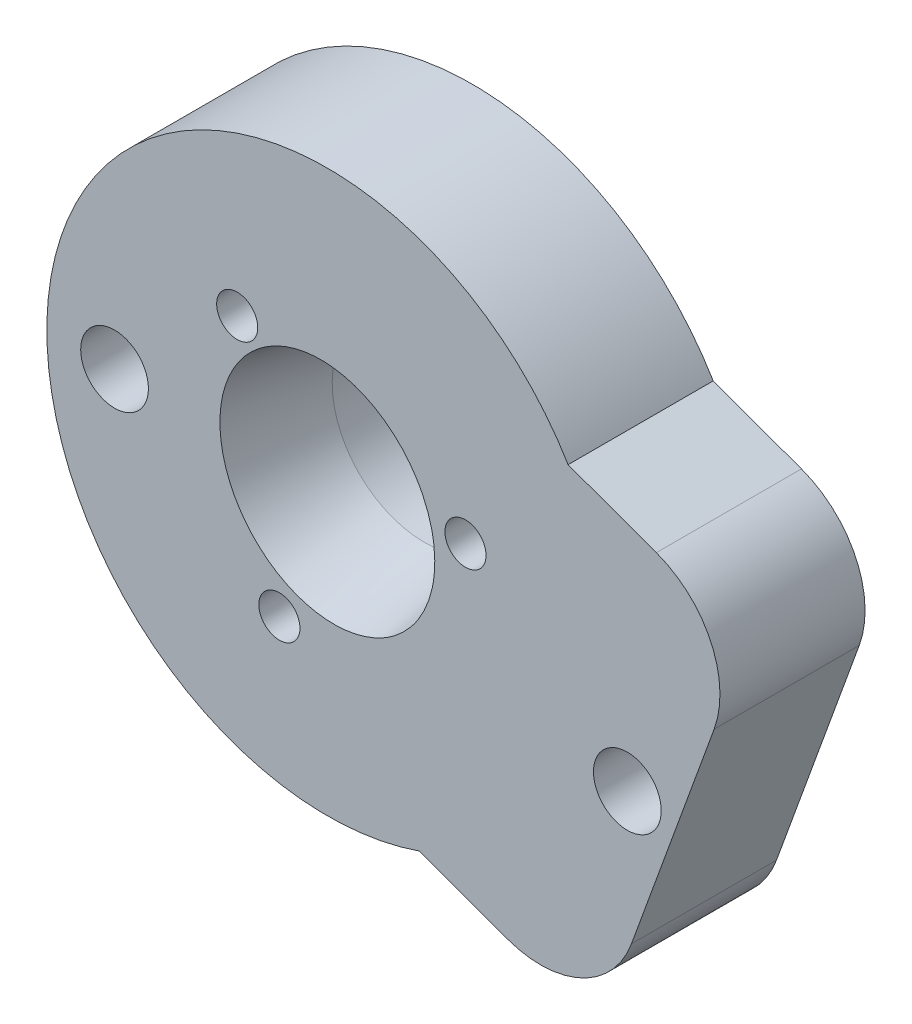
ISO-10303-21;
HEADER;
FILE_DESCRIPTION(('STEP AP214'),'2;1');
FILE_NAME('part.step','',(''),(''),'','','');
FILE_SCHEMA(('AUTOMOTIVE_DESIGN { 1 0 10303 214 1 1 1 1 }'));
ENDSEC;
DATA;
#1=APPLICATION_CONTEXT('core data for automotive mechanical design processes');
#2=APPLICATION_PROTOCOL_DEFINITION('international standard','automotive_design',2000,#1);
#3=PRODUCT_CONTEXT('',#1,'mechanical');
#4=PRODUCT('Part','Part','',(#3));
#5=PRODUCT_RELATED_PRODUCT_CATEGORY('part','',(#4));
#6=PRODUCT_DEFINITION_FORMATION('','',#4);
#7=PRODUCT_DEFINITION_CONTEXT('part definition',#1,'design');
#8=PRODUCT_DEFINITION('design','',#6,#7);
#9=PRODUCT_DEFINITION_SHAPE('','',#8);
#10=(LENGTH_UNIT() NAMED_UNIT(*) SI_UNIT(.MILLI.,.METRE.));
#11=(NAMED_UNIT(*) PLANE_ANGLE_UNIT() SI_UNIT($,.RADIAN.));
#12=(NAMED_UNIT(*) SI_UNIT($,.STERADIAN.) SOLID_ANGLE_UNIT());
#13=UNCERTAINTY_MEASURE_WITH_UNIT(LENGTH_MEASURE(1.E-05),#10,'distance_accuracy_value','');
#14=(GEOMETRIC_REPRESENTATION_CONTEXT(3) GLOBAL_UNCERTAINTY_ASSIGNED_CONTEXT((#13)) GLOBAL_UNIT_ASSIGNED_CONTEXT((#10,
#11,#12)) REPRESENTATION_CONTEXT('',''));
#15=CARTESIAN_POINT('',(0.,0.,0.));
#16=DIRECTION('',(0.,0.,1.));
#17=DIRECTION('',(1.,0.,0.));
#18=AXIS2_PLACEMENT_3D('',#15,#16,#17);
#19=CARTESIAN_POINT('',(0.,0.,10.));
#20=DIRECTION('',(0.,0.,-1.));
#21=DIRECTION('',(-1.,0.,0.));
#22=AXIS2_PLACEMENT_3D('',#19,#20,#21);
#23=CYLINDRICAL_SURFACE('',#22,29.);
#24=CARTESIAN_POINT('',(0.,0.,-5.));
#25=DIRECTION('',(0.,0.,1.));
#26=DIRECTION('',(1.,0.,0.));
#27=AXIS2_PLACEMENT_3D('',#24,#25,#26);
#28=CIRCLE('',#27,29.);
#29=CARTESIAN_POINT('',(24.88823335682,14.8854237553544,-5.));
#30=VERTEX_POINT('',#29);
#31=CARTESIAN_POINT('',(9.49732690716521,-27.4007441800115,-5.));
#32=VERTEX_POINT('',#31);
#33=EDGE_CURVE('E269',#30,#32,#28,.T.);
#34=ORIENTED_EDGE('',*,*,#33,.T.);
#35=DIRECTION('',(0.,0.,-1.));
#36=VECTOR('',#35,1.);
#37=CARTESIAN_POINT('',(9.4973269071652,-27.4007441800115,10.));
#38=LINE('',#37,#36);
#39=CARTESIAN_POINT('',(9.49732690716521,-27.4007441800115,10.));
#40=VERTEX_POINT('',#39);
#41=EDGE_CURVE('E161',#32,#40,#38,.F.);
#42=ORIENTED_EDGE('',*,*,#41,.T.);
#43=CARTESIAN_POINT('',(0.,0.,10.));
#44=DIRECTION('',(0.,0.,1.));
#45=DIRECTION('',(1.,0.,0.));
#46=AXIS2_PLACEMENT_3D('',#43,#44,#45);
#47=CIRCLE('',#46,29.);
#48=CARTESIAN_POINT('',(24.88823335682,14.8854237553544,10.));
#49=VERTEX_POINT('',#48);
#50=EDGE_CURVE('E13',#49,#40,#47,.T.);
#51=ORIENTED_EDGE('',*,*,#50,.F.);
#52=DIRECTION('',(0.,0.,-1.));
#53=VECTOR('',#52,1.);
#54=CARTESIAN_POINT('',(24.88823335682,14.8854237553544,10.));
#55=LINE('',#54,#53);
#56=EDGE_CURVE('E236',#30,#49,#55,.F.);
#57=ORIENTED_EDGE('',*,*,#56,.F.);
#58=EDGE_LOOP('',(#34,#42,#51,#57));
#59=FACE_BOUND('',#58,.T.);
#60=ADVANCED_FACE('F137',(#59),#23,.T.);
#61=CARTESIAN_POINT('',(0.,0.,10.));
#62=DIRECTION('',(0.,0.,1.));
#63=DIRECTION('',(1.,0.,0.));
#64=AXIS2_PLACEMENT_3D('',#61,#62,#63);
#65=PLANE('',#64);
#66=CARTESIAN_POINT('',(-22.,0.,10.));
#67=DIRECTION('',(0.,0.,1.));
#68=DIRECTION('',(1.,0.,0.));
#69=AXIS2_PLACEMENT_3D('',#66,#67,#68);
#70=CIRCLE('',#69,3.5);
#71=CARTESIAN_POINT('',(-18.5,0.,10.));
#72=VERTEX_POINT('',#71);
#73=EDGE_CURVE('E221',#72,#72,#70,.T.);
#74=ORIENTED_EDGE('',*,*,#73,.F.);
#75=EDGE_LOOP('',(#74));
#76=FACE_BOUND('',#75,.T.);
#77=ORIENTED_EDGE('',*,*,#50,.T.);
#78=DIRECTION('',(-0.939692620785911,0.342020143325662,0.));
#79=VECTOR('',#78,1.);
#80=CARTESIAN_POINT('',(18.6159401571781,-30.7196479808015,10.));
#81=LINE('',#80,#79);
#82=CARTESIAN_POINT('',(18.6159401571781,-30.7196479808015,10.));
#83=VERTEX_POINT('',#82);
#84=EDGE_CURVE('E237',#83,#40,#81,.T.);
#85=ORIENTED_EDGE('',*,*,#84,.F.);
#86=CARTESIAN_POINT('',(22.0361415904347,-21.3227217729424,10.));
#87=DIRECTION('',(0.,0.,1.));
#88=DIRECTION('',(1.,0.,0.));
#89=AXIS2_PLACEMENT_3D('',#86,#87,#88);
#90=CIRCLE('',#89,9.99999999999999);
#91=CARTESIAN_POINT('',(31.4330677982938,-24.7429232061991,10.));
#92=VERTEX_POINT('',#91);
#93=EDGE_CURVE('E199',#92,#83,#90,.F.);
#94=ORIENTED_EDGE('',*,*,#93,.F.);
#95=DIRECTION('',(0.342020143325663,0.93969262078591,0.));
#96=VECTOR('',#95,1.);
#97=CARTESIAN_POINT('',(31.4330677982938,-24.7429232061991,10.));
#98=LINE('',#97,#96);
#99=CARTESIAN_POINT('',(39.9835713814354,-1.25060768655132,10.));
#100=VERTEX_POINT('',#99);
#101=EDGE_CURVE('E215',#92,#100,#98,.T.);
#102=ORIENTED_EDGE('',*,*,#101,.T.);
#103=CARTESIAN_POINT('',(30.5866451735763,2.16959374670531,10.));
#104=DIRECTION('',(0.,0.,1.));
#105=DIRECTION('',(1.,0.,0.));
#106=AXIS2_PLACEMENT_3D('',#103,#104,#105);
#107=CIRCLE('',#106,10.);
#108=CARTESIAN_POINT('',(34.0068466068329,11.5665199545644,10.));
#109=VERTEX_POINT('',#108);
#110=EDGE_CURVE('E217',#100,#109,#107,.T.);
#111=ORIENTED_EDGE('',*,*,#110,.T.);
#112=DIRECTION('',(-0.93969262078591,0.342020143325664,0.));
#113=VECTOR('',#112,1.);
#114=CARTESIAN_POINT('',(34.0068466068329,11.5665199545644,10.));
#115=LINE('',#114,#113);
#116=EDGE_CURVE('E153',#109,#49,#115,.T.);
#117=ORIENTED_EDGE('',*,*,#116,.T.);
#118=EDGE_LOOP('',(#77,#85,#94,#102,#111,#117));
#119=FACE_BOUND('',#118,.T.);
#120=CARTESIAN_POINT('',(0.,0.,10.));
#121=DIRECTION('',(0.,0.,1.));
#122=DIRECTION('',(0.500000000000004,-0.866025403784436,0.));
#123=AXIS2_PLACEMENT_3D('',#120,#121,#122);
#124=ELLIPSE('',#123,11.7,10.9);
#125=CARTESIAN_POINT('',(5.85000000000005,-10.1324972242779,10.));
#126=VERTEX_POINT('',#125);
#127=EDGE_CURVE('E146',#126,#126,#124,.T.);
#128=ORIENTED_EDGE('',*,*,#127,.F.);
#129=EDGE_LOOP('',(#128));
#130=FACE_BOUND('',#129,.T.);
#131=CARTESIAN_POINT('',(-4.95929207822124,-13.6255430013952,10.));
#132=DIRECTION('',(0.,0.,1.));
#133=DIRECTION('',(1.,0.,0.));
#134=AXIS2_PLACEMENT_3D('',#131,#132,#133);
#135=CIRCLE('',#134,2.125);
#136=CARTESIAN_POINT('',(-2.83429207822124,-13.6255430013952,10.));
#137=VERTEX_POINT('',#136);
#138=EDGE_CURVE('E251',#137,#137,#135,.T.);
#139=ORIENTED_EDGE('',*,*,#138,.F.);
#140=EDGE_LOOP('',(#139));
#141=FACE_BOUND('',#140,.T.);
#142=CARTESIAN_POINT('',(14.279712418677,2.51789857617159,10.));
#143=DIRECTION('',(0.,0.,1.));
#144=DIRECTION('',(1.,0.,0.));
#145=AXIS2_PLACEMENT_3D('',#142,#143,#144);
#146=CIRCLE('',#145,2.125);
#147=CARTESIAN_POINT('',(16.404712418677,2.51789857617159,10.));
#148=VERTEX_POINT('',#147);
#149=EDGE_CURVE('E259',#148,#148,#146,.T.);
#150=ORIENTED_EDGE('',*,*,#149,.F.);
#151=EDGE_LOOP('',(#150));
#152=FACE_BOUND('',#151,.T.);
#153=CARTESIAN_POINT('',(-9.32042034045485,11.1076444252252,10.));
#154=DIRECTION('',(0.,0.,1.));
#155=DIRECTION('',(1.,0.,0.));
#156=AXIS2_PLACEMENT_3D('',#153,#154,#155);
#157=CIRCLE('',#156,2.125);
#158=CARTESIAN_POINT('',(-7.19542034045485,11.1076444252252,10.));
#159=VERTEX_POINT('',#158);
#160=EDGE_CURVE('E262',#159,#159,#157,.T.);
#161=ORIENTED_EDGE('',*,*,#160,.F.);
#162=EDGE_LOOP('',(#161));
#163=FACE_BOUND('',#162,.T.);
#164=CARTESIAN_POINT('',(31.009856485935,-11.2866647297469,10.));
#165=DIRECTION('',(0.,0.,1.));
#166=DIRECTION('',(1.,0.,0.));
#167=AXIS2_PLACEMENT_3D('',#164,#165,#166);
#168=CIRCLE('',#167,3.5);
#169=CARTESIAN_POINT('',(34.509856485935,-11.2866647297469,10.));
#170=VERTEX_POINT('',#169);
#171=EDGE_CURVE('E233',#170,#170,#168,.F.);
#172=ORIENTED_EDGE('',*,*,#171,.T.);
#173=EDGE_LOOP('',(#172));
#174=FACE_BOUND('',#173,.T.);
#175=ADVANCED_FACE('F310',(#76,#119,#130,#141,#152,#163,#174),#65,.T.);
#176=CARTESIAN_POINT('',(-8.2272413359522,-4.74999999999995,0.));
#177=CARTESIAN_POINT('',(-8.42931393016856,-4.86666666666662,1.66666666666667));
#178=CARTESIAN_POINT('',(-8.83345911860129,-5.09999999999996,5.));
#179=CARTESIAN_POINT('',(-9.237604307034,-5.33333333333335,8.33333333333333));
#180=CARTESIAN_POINT('',(-9.43967690125036,-5.45000000000005,10.));
#181=CARTESIAN_POINT('',(-7.60546779489093,-5.8269433639201,0.));
#182=CARTESIAN_POINT('',(-7.78706689015017,-5.97907117098922,1.66666666666667));
#183=CARTESIAN_POINT('',(-8.15026508066864,-6.28332678512747,5.));
#184=CARTESIAN_POINT('',(-8.51666298543088,-6.58204033162581,8.33333333333333));
#185=CARTESIAN_POINT('',(-8.699861937812,-6.73139710487497,10.));
#186=CARTESIAN_POINT('',(-5.93428765157635,-7.73339621782849,0.));
#187=CARTESIAN_POINT('',(-6.07184627964156,-7.95489124411117,1.66666666666666));
#188=CARTESIAN_POINT('',(-6.34696353577197,-8.39788129667655,5.));
#189=CARTESIAN_POINT('',(-6.62560368094945,-8.82043661085555,8.33333333333334));
#190=CARTESIAN_POINT('',(-6.76492375353818,-9.03171426794505,10.));
#191=CARTESIAN_POINT('',(-2.52271263730693,-9.41546349724764,0.));
#192=CARTESIAN_POINT('',(-2.57075740713248,-9.73346941615548,1.66666666666667));
#193=CARTESIAN_POINT('',(-2.66684694678358,-10.3694812539712,5.00000000000001));
#194=CARTESIAN_POINT('',(-2.77030559858351,-10.9465261862933,8.33333333333333));
#195=CARTESIAN_POINT('',(-2.82203492448348,-11.2350486524544,9.99999999999999));
#196=CARTESIAN_POINT('',(1.27227334912264,-9.66428554733693,0.));
#197=CARTESIAN_POINT('',(1.34693140463563,-10.0387457867895,1.66666666666666));
#198=CARTESIAN_POINT('',(1.49624751566162,-10.7876662656946,5.));
#199=CARTESIAN_POINT('',(1.61681931529875,-11.4482412450606,8.33333333333333));
#200=CARTESIAN_POINT('',(1.67710521511731,-11.7785287347436,9.99999999999999));
#201=CARTESIAN_POINT('',(4.8738319958937,-8.44172464444286,0.));
#202=CARTESIAN_POINT('',(5.07724941175743,-8.79405394386322,1.66666666666667));
#203=CARTESIAN_POINT('',(5.48408424348489,-9.49871254270392,5.00000000000002));
#204=CARTESIAN_POINT('',(5.83864101663948,-10.1128228879752,8.33333333333335));
#205=CARTESIAN_POINT('',(6.01591940321678,-10.4198780606109,10.));
#206=CARTESIAN_POINT('',(7.73338011885922,-5.93396381456668,0.));
#207=CARTESIAN_POINT('',(8.02034317117585,-6.18584970696435,1.66666666666666));
#208=CARTESIAN_POINT('',(8.59426927580909,-6.68962149175969,4.99999999999998));
#209=CARTESIAN_POINT('',(9.10605808922591,-7.12432722290843,8.33333333333333));
#210=CARTESIAN_POINT('',(9.36195249593433,-7.34168008848279,10.));
#211=CARTESIAN_POINT('',(9.41538689567493,-2.52299851826811,0.));
#212=CARTESIAN_POINT('',(9.71481048491571,-2.64039348653412,1.66666666666667));
#213=CARTESIAN_POINT('',(10.3136576633973,-2.87518342306615,5.00000000000003));
#214=CARTESIAN_POINT('',(10.8651225598133,-3.07410806852712,8.33333333333334));
#215=CARTESIAN_POINT('',(11.1408550080214,-3.17357039125761,10.));
#216=CARTESIAN_POINT('',(9.66446140795818,1.27254575071504,0.));
#217=CARTESIAN_POINT('',(9.92506104156348,1.28092750398791,1.66666666666666));
#218=CARTESIAN_POINT('',(10.4462603087741,1.29769101053365,4.99999999999998));
#219=CARTESIAN_POINT('',(10.951524017946,1.32772279768209,8.33333333333333));
#220=CARTESIAN_POINT('',(11.2041558725319,1.34273869125631,10.));
#221=CARTESIAN_POINT('',(8.84901487701347,3.6730566360798,0.));
#222=CARTESIAN_POINT('',(9.07156097018697,3.75426216234402,1.66666666666667));
#223=CARTESIAN_POINT('',(9.51665315653395,3.91667321487245,5.));
#224=CARTESIAN_POINT('',(9.95854562863716,4.08462633504082,8.33333333333333));
#225=CARTESIAN_POINT('',(10.1794918646888,4.16860289512501,10.));
#226=CARTESIAN_POINT('',(7.60546779489093,5.8269433639201,0.));
#227=CARTESIAN_POINT('',(7.78706689015017,5.97907117098922,1.66666666666667));
#228=CARTESIAN_POINT('',(8.15026508066865,6.28332678512746,5.));
#229=CARTESIAN_POINT('',(8.51666298543093,6.58204033162574,8.33333333333333));
#230=CARTESIAN_POINT('',(8.69986193781207,6.73139710487488,10.));
#231=CARTESIAN_POINT('',(5.93428765157634,7.73339621782852,0.));
#232=CARTESIAN_POINT('',(6.07184627964155,7.95489124411119,1.66666666666667));
#233=CARTESIAN_POINT('',(6.34696353577197,8.39788129667652,5.));
#234=CARTESIAN_POINT('',(6.62560368094951,8.82043661085551,8.33333333333334));
#235=CARTESIAN_POINT('',(6.76492375353827,9.031714267945,10.));
#236=CARTESIAN_POINT('',(2.52271263730692,9.41546349724761,0.));
#237=CARTESIAN_POINT('',(2.57075740713246,9.73346941615547,1.66666666666667));
#238=CARTESIAN_POINT('',(2.66684694678356,10.3694812539712,5.00000000000001));
#239=CARTESIAN_POINT('',(2.77030559858355,10.9465261862933,8.33333333333332));
#240=CARTESIAN_POINT('',(2.82203492448355,11.2350486524544,9.99999999999998));
#241=CARTESIAN_POINT('',(-1.27227334912264,9.66428554733697,0.));
#242=CARTESIAN_POINT('',(-1.34693140463563,10.0387457867895,1.66666666666666));
#243=CARTESIAN_POINT('',(-1.49624751566162,10.7876662656946,4.99999999999999));
#244=CARTESIAN_POINT('',(-1.61681931529871,11.4482412450606,8.33333333333335));
#245=CARTESIAN_POINT('',(-1.67710521511726,11.7785287347437,10.));
#246=CARTESIAN_POINT('',(-4.87383199589369,8.44172464444285,0.));
#247=CARTESIAN_POINT('',(-5.07724941175744,8.7940539438632,1.66666666666667));
#248=CARTESIAN_POINT('',(-5.48408424348494,9.49871254270392,5.00000000000002));
#249=CARTESIAN_POINT('',(-5.83864101663949,10.1128228879752,8.33333333333332));
#250=CARTESIAN_POINT('',(-6.01591940321676,10.4198780606109,9.99999999999997));
#251=CARTESIAN_POINT('',(-7.73338011885922,5.9339638145667,0.));
#252=CARTESIAN_POINT('',(-8.02034317117583,6.18584970696437,1.66666666666666));
#253=CARTESIAN_POINT('',(-8.59426927580905,6.6896214917597,4.99999999999999));
#254=CARTESIAN_POINT('',(-9.10605808922591,7.12432722290842,8.33333333333336));
#255=CARTESIAN_POINT('',(-9.36195249593434,7.34168008848277,10.));
#256=CARTESIAN_POINT('',(-9.41538689567493,2.52299851826811,0.));
#257=CARTESIAN_POINT('',(-9.71481048491571,2.64039348653411,1.66666666666666));
#258=CARTESIAN_POINT('',(-10.3136576633973,2.87518342306611,4.99999999999999));
#259=CARTESIAN_POINT('',(-10.8651225598134,3.07410806852708,8.3333333333333));
#260=CARTESIAN_POINT('',(-11.1408550080214,3.17357039125757,9.99999999999996));
#261=CARTESIAN_POINT('',(-9.66446140795817,-1.27254575071502,0.));
#262=CARTESIAN_POINT('',(-9.92506104156348,-1.28092750398789,1.66666666666667));
#263=CARTESIAN_POINT('',(-10.4462603087741,-1.29769101053363,5.00000000000001));
#264=CARTESIAN_POINT('',(-10.951524017946,-1.32772279768215,8.33333333333336));
#265=CARTESIAN_POINT('',(-11.2041558725319,-1.34273869125641,10.));
#266=CARTESIAN_POINT('',(-8.84901487701347,-3.6730566360798,0.));
#267=CARTESIAN_POINT('',(-9.07156097018697,-3.75426216234402,1.66666666666667));
#268=CARTESIAN_POINT('',(-9.51665315653394,-3.91667321487246,5.));
#269=CARTESIAN_POINT('',(-9.95854562863712,-4.08462633504089,8.33333333333333));
#270=CARTESIAN_POINT('',(-10.1794918646887,-4.16860289512511,10.));
#271=CARTESIAN_POINT('',(-8.2272413359522,-4.74999999999995,0.));
#272=CARTESIAN_POINT('',(-8.42931393016856,-4.86666666666662,1.66666666666667));
#273=CARTESIAN_POINT('',(-8.83345911860129,-5.09999999999996,5.));
#274=CARTESIAN_POINT('',(-9.237604307034,-5.33333333333335,8.33333333333333));
#275=CARTESIAN_POINT('',(-9.43967690125036,-5.45000000000005,10.));
#276=B_SPLINE_SURFACE_WITH_KNOTS('',3,3,((#176,#177,#178,#179,#180),(#181,#182,#183,#184,#185),
(#186,#187,#188,#189,#190),(#191,#192,#193,#194,#195),(#196,#197,#198,#199,#200),(#201,#202,
#203,#204,#205),(#206,#207,#208,#209,#210),(#211,#212,#213,#214,#215),(#216,#217,#218,#219,
#220),(#221,#222,#223,#224,#225),(#226,#227,#228,#229,#230),(#231,#232,#233,#234,#235),(#236,
#237,#238,#239,#240),(#241,#242,#243,#244,#245),(#246,#247,#248,#249,#250),(#251,#252,#253,#254,
#255),(#256,#257,#258,#259,#260),(#261,#262,#263,#264,#265),(#266,#267,#268,#269,#270),(#271,
#272,#273,#274,#275)),.UNSPECIFIED.,.T.,.F.,.F.,(4,1,1,1,1,1,1,1,2,1,1,1,1,1,1,1,4),(4,1,4),(0.,
0.0624999999999999,0.125,0.1875,0.25,0.3125,0.375,0.437499999999999,0.499999999999999,
0.562499999999999,0.624999999999999,0.6875,0.75,0.8125,0.875,0.9375,1.),(0.,0.5,1.),.UNSPECIFIED.);
#277=CARTESIAN_POINT('',(0.,0.,0.));
#278=DIRECTION('',(0.,0.,1.));
#279=DIRECTION('',(0.500000000000004,-0.866025403784436,0.));
#280=AXIS2_PLACEMENT_3D('',#277,#278,#279);
#281=ELLIPSE('',#280,9.50000000000001,9.50000000000001);
#282=CARTESIAN_POINT('',(4.75000000000004,-8.22724133595215,0.));
#283=VERTEX_POINT('',#282);
#284=EDGE_CURVE('E294',#283,#283,#281,.T.);
#285=ORIENTED_EDGE('',*,*,#284,.F.);
#286=EDGE_LOOP('',(#285));
#287=FACE_BOUND('',#286,.T.);
#288=ORIENTED_EDGE('',*,*,#127,.T.);
#289=EDGE_LOOP('',(#288));
#290=FACE_BOUND('',#289,.T.);
#291=ADVANCED_FACE('F300',(#287,#290),#276,.F.);
#292=CARTESIAN_POINT('',(0.,0.,-5.));
#293=DIRECTION('',(0.,0.,1.));
#294=DIRECTION('',(1.,0.,0.));
#295=AXIS2_PLACEMENT_3D('',#292,#293,#294);
#296=PLANE('',#295);
#297=CARTESIAN_POINT('',(-22.,0.,-5.));
#298=DIRECTION('',(0.,0.,-1.));
#299=DIRECTION('',(-1.,0.,0.));
#300=AXIS2_PLACEMENT_3D('',#297,#298,#299);
#301=CIRCLE('',#300,3.5);
#302=CARTESIAN_POINT('',(-25.5,0.,-5.));
#303=VERTEX_POINT('',#302);
#304=EDGE_CURVE('E503',#303,#303,#301,.T.);
#305=ORIENTED_EDGE('',*,*,#304,.F.);
#306=EDGE_LOOP('',(#305));
#307=FACE_BOUND('',#306,.T.);
#308=ORIENTED_EDGE('',*,*,#33,.F.);
#309=DIRECTION('',(-0.93969262078591,0.342020143325664,0.));
#310=VECTOR('',#309,1.);
#311=CARTESIAN_POINT('',(34.0068466068329,11.5665199545644,-5.));
#312=LINE('',#311,#310);
#313=CARTESIAN_POINT('',(34.0068466068329,11.5665199545644,-5.));
#314=VERTEX_POINT('',#313);
#315=EDGE_CURVE('E229',#314,#30,#312,.T.);
#316=ORIENTED_EDGE('',*,*,#315,.F.);
#317=CARTESIAN_POINT('',(30.5866451735763,2.16959374670531,-5.));
#318=DIRECTION('',(0.,0.,1.));
#319=DIRECTION('',(1.,0.,0.));
#320=AXIS2_PLACEMENT_3D('',#317,#318,#319);
#321=CIRCLE('',#320,10.);
#322=CARTESIAN_POINT('',(39.9835713814354,-1.25060768655132,-5.));
#323=VERTEX_POINT('',#322);
#324=EDGE_CURVE('E225',#323,#314,#321,.T.);
#325=ORIENTED_EDGE('',*,*,#324,.F.);
#326=DIRECTION('',(0.342020143325663,0.93969262078591,0.));
#327=VECTOR('',#326,1.);
#328=CARTESIAN_POINT('',(31.4330677982938,-24.7429232061991,-5.));
#329=LINE('',#328,#327);
#330=CARTESIAN_POINT('',(31.4330677982938,-24.7429232061991,-5.));
#331=VERTEX_POINT('',#330);
#332=EDGE_CURVE('E214',#331,#323,#329,.T.);
#333=ORIENTED_EDGE('',*,*,#332,.F.);
#334=CARTESIAN_POINT('',(22.0361415904347,-21.3227217729424,-5.));
#335=DIRECTION('',(0.,0.,-1.));
#336=DIRECTION('',(-1.,0.,0.));
#337=AXIS2_PLACEMENT_3D('',#334,#335,#336);
#338=CIRCLE('',#337,9.99999999999999);
#339=CARTESIAN_POINT('',(18.6159401571781,-30.7196479808015,-5.));
#340=VERTEX_POINT('',#339);
#341=EDGE_CURVE('E198',#331,#340,#338,.T.);
#342=ORIENTED_EDGE('',*,*,#341,.T.);
#343=DIRECTION('',(-0.939692620785911,0.342020143325662,0.));
#344=VECTOR('',#343,1.);
#345=CARTESIAN_POINT('',(18.6159401571781,-30.7196479808015,-5.));
#346=LINE('',#345,#344);
#347=EDGE_CURVE('E202',#340,#32,#346,.T.);
#348=ORIENTED_EDGE('',*,*,#347,.T.);
#349=EDGE_LOOP('',(#308,#316,#325,#333,#342,#348));
#350=FACE_BOUND('',#349,.T.);
#351=CARTESIAN_POINT('',(-9.32042034045485,11.1076444252252,-5.));
#352=DIRECTION('',(0.,0.,1.));
#353=DIRECTION('',(1.,0.,0.));
#354=AXIS2_PLACEMENT_3D('',#351,#352,#353);
#355=CIRCLE('',#354,2.125);
#356=CARTESIAN_POINT('',(-7.19542034045485,11.1076444252252,-5.));
#357=VERTEX_POINT('',#356);
#358=EDGE_CURVE('E248',#357,#357,#355,.T.);
#359=ORIENTED_EDGE('',*,*,#358,.T.);
#360=EDGE_LOOP('',(#359));
#361=FACE_BOUND('',#360,.T.);
#362=CARTESIAN_POINT('',(14.279712418677,2.51789857617159,-5.));
#363=DIRECTION('',(0.,0.,1.));
#364=DIRECTION('',(1.,0.,0.));
#365=AXIS2_PLACEMENT_3D('',#362,#363,#364);
#366=CIRCLE('',#365,2.125);
#367=CARTESIAN_POINT('',(16.404712418677,2.51789857617159,-5.));
#368=VERTEX_POINT('',#367);
#369=EDGE_CURVE('E252',#368,#368,#366,.T.);
#370=ORIENTED_EDGE('',*,*,#369,.T.);
#371=EDGE_LOOP('',(#370));
#372=FACE_BOUND('',#371,.T.);
#373=CARTESIAN_POINT('',(-4.95929207822124,-13.6255430013952,-5.));
#374=DIRECTION('',(0.,0.,1.));
#375=DIRECTION('',(1.,0.,0.));
#376=AXIS2_PLACEMENT_3D('',#373,#374,#375);
#377=CIRCLE('',#376,2.125);
#378=CARTESIAN_POINT('',(-2.83429207822124,-13.6255430013952,-5.));
#379=VERTEX_POINT('',#378);
#380=EDGE_CURVE('E247',#379,#379,#377,.T.);
#381=ORIENTED_EDGE('',*,*,#380,.T.);
#382=EDGE_LOOP('',(#381));
#383=FACE_BOUND('',#382,.T.);
#384=CARTESIAN_POINT('',(0.,0.,-5.));
#385=DIRECTION('',(0.,0.,1.));
#386=DIRECTION('',(0.500000000000004,-0.866025403784436,0.));
#387=AXIS2_PLACEMENT_3D('',#384,#385,#386);
#388=ELLIPSE('',#387,9.50000000000001,9.50000000000001);
#389=CARTESIAN_POINT('',(4.75000000000004,-8.22724133595215,-5.));
#390=VERTEX_POINT('',#389);
#391=EDGE_CURVE('E265',#390,#390,#388,.T.);
#392=ORIENTED_EDGE('',*,*,#391,.T.);
#393=EDGE_LOOP('',(#392));
#394=FACE_BOUND('',#393,.T.);
#395=CARTESIAN_POINT('',(31.009856485935,-11.2866647297469,-5.));
#396=DIRECTION('',(0.,0.,-1.));
#397=DIRECTION('',(-1.,0.,0.));
#398=AXIS2_PLACEMENT_3D('',#395,#396,#397);
#399=CIRCLE('',#398,3.5);
#400=CARTESIAN_POINT('',(27.509856485935,-11.2866647297469,-5.));
#401=VERTEX_POINT('',#400);
#402=EDGE_CURVE('E207',#401,#401,#399,.T.);
#403=ORIENTED_EDGE('',*,*,#402,.F.);
#404=EDGE_LOOP('',(#403));
#405=FACE_BOUND('',#404,.T.);
#406=ADVANCED_FACE('F210',(#307,#350,#361,#372,#383,#394,#405),#296,.F.);
#407=DIRECTION('',(0.,0.,1.));
#408=VECTOR('',#407,1.);
#409=SURFACE_OF_LINEAR_EXTRUSION('',#388,#408);
#410=ORIENTED_EDGE('',*,*,#391,.F.);
#411=EDGE_LOOP('',(#410));
#412=FACE_BOUND('',#411,.T.);
#413=ORIENTED_EDGE('',*,*,#284,.T.);
#414=EDGE_LOOP('',(#413));
#415=FACE_BOUND('',#414,.T.);
#416=ADVANCED_FACE('F272',(#412,#415),#409,.F.);
#417=CARTESIAN_POINT('',(-4.95929207822124,-13.6255430013952,-5.));
#418=DIRECTION('',(0.,0.,1.));
#419=DIRECTION('',(1.,0.,0.));
#420=AXIS2_PLACEMENT_3D('',#417,#418,#419);
#421=CYLINDRICAL_SURFACE('',#420,2.125);
#422=ORIENTED_EDGE('',*,*,#138,.T.);
#423=EDGE_LOOP('',(#422));
#424=FACE_BOUND('',#423,.T.);
#425=ORIENTED_EDGE('',*,*,#380,.F.);
#426=EDGE_LOOP('',(#425));
#427=FACE_BOUND('',#426,.T.);
#428=ADVANCED_FACE('F277',(#424,#427),#421,.F.);
#429=CARTESIAN_POINT('',(14.279712418677,2.51789857617159,-5.));
#430=DIRECTION('',(0.,0.,1.));
#431=DIRECTION('',(1.,0.,0.));
#432=AXIS2_PLACEMENT_3D('',#429,#430,#431);
#433=CYLINDRICAL_SURFACE('',#432,2.125);
#434=ORIENTED_EDGE('',*,*,#149,.T.);
#435=EDGE_LOOP('',(#434));
#436=FACE_BOUND('',#435,.T.);
#437=ORIENTED_EDGE('',*,*,#369,.F.);
#438=EDGE_LOOP('',(#437));
#439=FACE_BOUND('',#438,.T.);
#440=ADVANCED_FACE('F389',(#436,#439),#433,.F.);
#441=CARTESIAN_POINT('',(-9.32042034045485,11.1076444252252,-5.));
#442=DIRECTION('',(0.,0.,1.));
#443=DIRECTION('',(1.,0.,0.));
#444=AXIS2_PLACEMENT_3D('',#441,#442,#443);
#445=CYLINDRICAL_SURFACE('',#444,2.125);
#446=ORIENTED_EDGE('',*,*,#160,.T.);
#447=EDGE_LOOP('',(#446));
#448=FACE_BOUND('',#447,.T.);
#449=ORIENTED_EDGE('',*,*,#358,.F.);
#450=EDGE_LOOP('',(#449));
#451=FACE_BOUND('',#450,.T.);
#452=ADVANCED_FACE('F384',(#448,#451),#445,.F.);
#453=CARTESIAN_POINT('',(18.6159401571781,-30.7196479808015,65.7566570572385));
#454=DIRECTION('',(-0.342020143325662,-0.939692620785911,0.));
#455=DIRECTION('',(0.939692620785911,-0.342020143325662,0.));
#456=AXIS2_PLACEMENT_3D('',#453,#454,#455);
#457=PLANE('',#456);
#458=ORIENTED_EDGE('',*,*,#41,.F.);
#459=ORIENTED_EDGE('',*,*,#347,.F.);
#460=DIRECTION('',(0.,0.,-1.));
#461=VECTOR('',#460,1.);
#462=CARTESIAN_POINT('',(18.6159401571781,-30.7196479808015,65.7566570572385));
#463=LINE('',#462,#461);
#464=EDGE_CURVE('E194',#83,#340,#463,.T.);
#465=ORIENTED_EDGE('',*,*,#464,.F.);
#466=ORIENTED_EDGE('',*,*,#84,.T.);
#467=EDGE_LOOP('',(#458,#459,#465,#466));
#468=FACE_BOUND('',#467,.T.);
#469=ADVANCED_FACE('F203',(#468),#457,.T.);
#470=CARTESIAN_POINT('',(34.0068466068329,11.5665199545644,65.7566570572385));
#471=DIRECTION('',(-0.342020143325664,-0.93969262078591,0.));
#472=DIRECTION('',(0.93969262078591,-0.342020143325664,0.));
#473=AXIS2_PLACEMENT_3D('',#470,#471,#472);
#474=PLANE('',#473);
#475=ORIENTED_EDGE('',*,*,#315,.T.);
#476=ORIENTED_EDGE('',*,*,#56,.T.);
#477=ORIENTED_EDGE('',*,*,#116,.F.);
#478=DIRECTION('',(0.,0.,-1.));
#479=VECTOR('',#478,1.);
#480=CARTESIAN_POINT('',(34.0068466068329,11.5665199545644,65.7566570572385));
#481=LINE('',#480,#479);
#482=EDGE_CURVE('E228',#109,#314,#481,.T.);
#483=ORIENTED_EDGE('',*,*,#482,.T.);
#484=EDGE_LOOP('',(#475,#476,#477,#483));
#485=FACE_BOUND('',#484,.T.);
#486=ADVANCED_FACE('F370',(#485),#474,.F.);
#487=CARTESIAN_POINT('',(22.0361415904347,-21.3227217729424,65.7566570572385));
#488=DIRECTION('',(0.,0.,-1.));
#489=DIRECTION('',(-1.,0.,0.));
#490=AXIS2_PLACEMENT_3D('',#487,#488,#489);
#491=CYLINDRICAL_SURFACE('',#490,9.99999999999999);
#492=DIRECTION('',(0.,0.,-1.));
#493=VECTOR('',#492,1.);
#494=CARTESIAN_POINT('',(31.4330677982938,-24.7429232061991,65.7566570572385));
#495=LINE('',#494,#493);
#496=EDGE_CURVE('E200',#92,#331,#495,.T.);
#497=ORIENTED_EDGE('',*,*,#496,.F.);
#498=ORIENTED_EDGE('',*,*,#93,.T.);
#499=ORIENTED_EDGE('',*,*,#464,.T.);
#500=ORIENTED_EDGE('',*,*,#341,.F.);
#501=EDGE_LOOP('',(#497,#498,#499,#500));
#502=FACE_BOUND('',#501,.T.);
#503=ADVANCED_FACE('F196',(#502),#491,.T.);
#504=CARTESIAN_POINT('',(31.4330677982938,-24.7429232061991,65.7566570572385));
#505=DIRECTION('',(-0.93969262078591,0.342020143325663,0.));
#506=DIRECTION('',(-0.342020143325663,-0.93969262078591,0.));
#507=AXIS2_PLACEMENT_3D('',#504,#505,#506);
#508=PLANE('',#507);
#509=ORIENTED_EDGE('',*,*,#101,.F.);
#510=ORIENTED_EDGE('',*,*,#496,.T.);
#511=ORIENTED_EDGE('',*,*,#332,.T.);
#512=DIRECTION('',(0.,0.,-1.));
#513=VECTOR('',#512,1.);
#514=CARTESIAN_POINT('',(39.9835713814354,-1.25060768655132,65.7566570572385));
#515=LINE('',#514,#513);
#516=EDGE_CURVE('E224',#100,#323,#515,.T.);
#517=ORIENTED_EDGE('',*,*,#516,.F.);
#518=EDGE_LOOP('',(#509,#510,#511,#517));
#519=FACE_BOUND('',#518,.T.);
#520=ADVANCED_FACE('F357',(#519),#508,.F.);
#521=CARTESIAN_POINT('',(30.5866451735763,2.16959374670531,65.7566570572385));
#522=DIRECTION('',(0.,0.,-1.));
#523=DIRECTION('',(-1.,0.,0.));
#524=AXIS2_PLACEMENT_3D('',#521,#522,#523);
#525=CYLINDRICAL_SURFACE('',#524,10.);
#526=ORIENTED_EDGE('',*,*,#110,.F.);
#527=ORIENTED_EDGE('',*,*,#516,.T.);
#528=ORIENTED_EDGE('',*,*,#324,.T.);
#529=ORIENTED_EDGE('',*,*,#482,.F.);
#530=EDGE_LOOP('',(#526,#527,#528,#529));
#531=FACE_BOUND('',#530,.T.);
#532=ADVANCED_FACE('F348',(#531),#525,.T.);
#533=CARTESIAN_POINT('',(31.009856485935,-11.2866647297469,65.7566570572385));
#534=DIRECTION('',(0.,0.,-1.));
#535=DIRECTION('',(-1.,0.,0.));
#536=AXIS2_PLACEMENT_3D('',#533,#534,#535);
#537=CYLINDRICAL_SURFACE('',#536,3.5);
#538=ORIENTED_EDGE('',*,*,#402,.T.);
#539=EDGE_LOOP('',(#538));
#540=FACE_BOUND('',#539,.T.);
#541=ORIENTED_EDGE('',*,*,#171,.F.);
#542=EDGE_LOOP('',(#541));
#543=FACE_BOUND('',#542,.T.);
#544=ADVANCED_FACE('F345',(#540,#543),#537,.F.);
#545=CARTESIAN_POINT('',(-22.,0.,10.0113971829946));
#546=DIRECTION('',(0.,0.,-1.));
#547=DIRECTION('',(-1.,0.,0.));
#548=AXIS2_PLACEMENT_3D('',#545,#546,#547);
#549=CYLINDRICAL_SURFACE('',#548,3.5);
#550=ORIENTED_EDGE('',*,*,#73,.T.);
#551=EDGE_LOOP('',(#550));
#552=FACE_BOUND('',#551,.T.);
#553=ORIENTED_EDGE('',*,*,#304,.T.);
#554=EDGE_LOOP('',(#553));
#555=FACE_BOUND('',#554,.T.);
#556=ADVANCED_FACE('F347',(#552,#555),#549,.F.);
#557=CLOSED_SHELL('',(#60,#175,#291,#406,#416,#428,#440,#452,#469,#486,#503,#520,#532,#544,#556));
#558=MANIFOLD_SOLID_BREP('B2',#557);
#559=ADVANCED_BREP_SHAPE_REPRESENTATION('',(#18,#558),#14);
#560=SHAPE_DEFINITION_REPRESENTATION(#9,#559);
ENDSEC;
END-ISO-10303-21;
